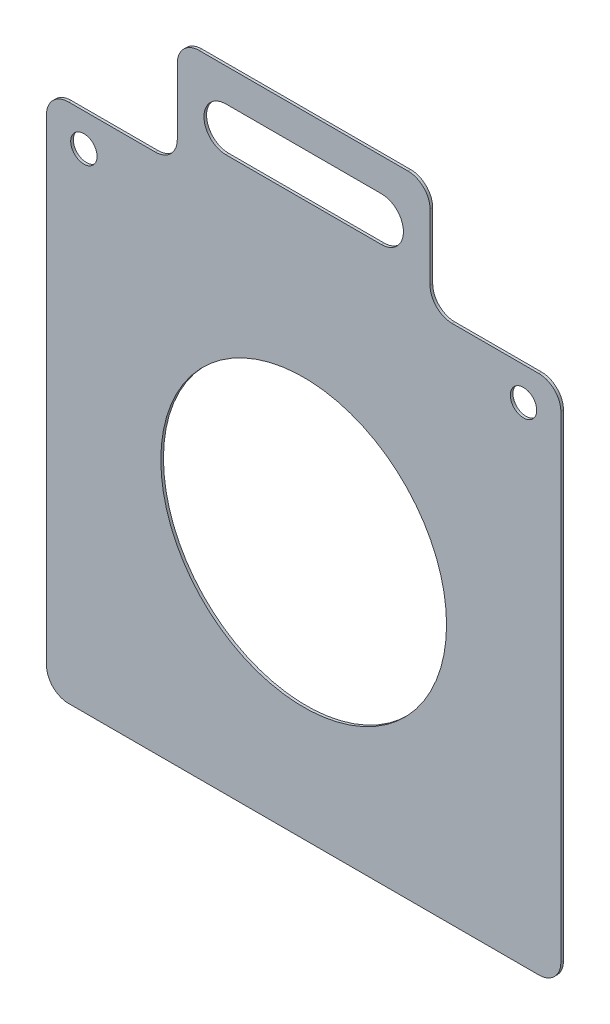
ISO-10303-21;
HEADER;
FILE_DESCRIPTION(('STEP AP214'),'2;1');
FILE_NAME('part.step','',(''),(''),'','','');
FILE_SCHEMA(('AUTOMOTIVE_DESIGN { 1 0 10303 214 1 1 1 1 }'));
ENDSEC;
DATA;
#1=APPLICATION_CONTEXT('core data for automotive mechanical design processes');
#2=APPLICATION_PROTOCOL_DEFINITION('international standard','automotive_design',2000,#1);
#3=PRODUCT_CONTEXT('',#1,'mechanical');
#4=PRODUCT('Part','Part','',(#3));
#5=PRODUCT_RELATED_PRODUCT_CATEGORY('part','',(#4));
#6=PRODUCT_DEFINITION_FORMATION('','',#4);
#7=PRODUCT_DEFINITION_CONTEXT('part definition',#1,'design');
#8=PRODUCT_DEFINITION('design','',#6,#7);
#9=PRODUCT_DEFINITION_SHAPE('','',#8);
#10=(LENGTH_UNIT() NAMED_UNIT(*) SI_UNIT(.MILLI.,.METRE.));
#11=(NAMED_UNIT(*) PLANE_ANGLE_UNIT() SI_UNIT($,.RADIAN.));
#12=(NAMED_UNIT(*) SI_UNIT($,.STERADIAN.) SOLID_ANGLE_UNIT());
#13=UNCERTAINTY_MEASURE_WITH_UNIT(LENGTH_MEASURE(1.E-05),#10,'distance_accuracy_value','');
#14=(GEOMETRIC_REPRESENTATION_CONTEXT(3) GLOBAL_UNCERTAINTY_ASSIGNED_CONTEXT((#13)) GLOBAL_UNIT_ASSIGNED_CONTEXT((#10,
#11,#12)) REPRESENTATION_CONTEXT('',''));
#15=CARTESIAN_POINT('',(0.,0.,0.));
#16=DIRECTION('',(0.,0.,1.));
#17=DIRECTION('',(1.,0.,0.));
#18=AXIS2_PLACEMENT_3D('',#15,#16,#17);
#19=CARTESIAN_POINT('',(-117.,120.000000000001,1.20000000000002));
#20=DIRECTION('',(0.,-1.,0.));
#21=DIRECTION('',(1.,0.,0.));
#22=AXIS2_PLACEMENT_3D('',#19,#20,#21);
#23=PLANE('',#22);
#24=DIRECTION('',(-1.,0.,0.));
#25=VECTOR('',#24,1.);
#26=CARTESIAN_POINT('',(-117.,120.000000000001,1.20000000000002));
#27=LINE('',#26,#25);
#28=CARTESIAN_POINT('',(-67.5000000000001,120.000000000001,1.20000000000002));
#29=VERTEX_POINT('',#28);
#30=CARTESIAN_POINT('',(-107.,120.,1.20000000000002));
#31=VERTEX_POINT('',#30);
#32=EDGE_CURVE('E276',#29,#31,#27,.T.);
#33=ORIENTED_EDGE('',*,*,#32,.F.);
#34=DIRECTION('',(0.,0.,1.));
#35=VECTOR('',#34,1.);
#36=CARTESIAN_POINT('',(-67.5000000000001,120.000000000001,1.20000000000002));
#37=LINE('',#36,#35);
#38=CARTESIAN_POINT('',(-67.5000000000001,120.000000000001,0.));
#39=VERTEX_POINT('',#38);
#40=EDGE_CURVE('E361',#29,#39,#37,.F.);
#41=ORIENTED_EDGE('',*,*,#40,.T.);
#42=DIRECTION('',(-1.,0.,0.));
#43=VECTOR('',#42,1.);
#44=CARTESIAN_POINT('',(-117.,120.000000000001,0.));
#45=LINE('',#44,#43);
#46=CARTESIAN_POINT('',(-107.,120.,0.));
#47=VERTEX_POINT('',#46);
#48=EDGE_CURVE('E291',#39,#47,#45,.T.);
#49=ORIENTED_EDGE('',*,*,#48,.T.);
#50=DIRECTION('',(0.,0.,-1.));
#51=VECTOR('',#50,1.);
#52=CARTESIAN_POINT('',(-107.,120.,1.20000000000002));
#53=LINE('',#52,#51);
#54=EDGE_CURVE('E358',#47,#31,#53,.F.);
#55=ORIENTED_EDGE('',*,*,#54,.T.);
#56=EDGE_LOOP('',(#33,#41,#49,#55));
#57=FACE_BOUND('',#56,.T.);
#58=ADVANCED_FACE('F40',(#57),#23,.F.);
#59=CARTESIAN_POINT('',(0.,0.,1.20000000000001));
#60=DIRECTION('',(0.,0.,1.));
#61=DIRECTION('',(1.,0.,0.));
#62=AXIS2_PLACEMENT_3D('',#59,#60,#61);
#63=PLANE('',#62);
#64=CARTESIAN_POINT('',(-100.,105.,1.20000000000002));
#65=DIRECTION('',(0.,0.,1.));
#66=DIRECTION('',(1.,0.,0.));
#67=AXIS2_PLACEMENT_3D('',#64,#65,#66);
#68=CIRCLE('',#67,6.);
#69=CARTESIAN_POINT('',(-94.0000000000003,105.,1.20000000000002));
#70=VERTEX_POINT('',#69);
#71=EDGE_CURVE('E247',#70,#70,#68,.T.);
#72=ORIENTED_EDGE('',*,*,#71,.F.);
#73=EDGE_LOOP('',(#72));
#74=FACE_BOUND('',#73,.T.);
#75=DIRECTION('',(0.,1.,0.));
#76=VECTOR('',#75,1.);
#77=CARTESIAN_POINT('',(57.5000000000002,170.000000000002,1.20000000000002));
#78=LINE('',#77,#76);
#79=CARTESIAN_POINT('',(57.5000000000003,130.000000000001,1.20000000000002));
#80=VERTEX_POINT('',#79);
#81=CARTESIAN_POINT('',(57.5000000000001,160.000000000002,1.20000000000002));
#82=VERTEX_POINT('',#81);
#83=EDGE_CURVE('E217',#80,#82,#78,.T.);
#84=ORIENTED_EDGE('',*,*,#83,.T.);
#85=CARTESIAN_POINT('',(47.5,160.000000000002,1.20000000000002));
#86=DIRECTION('',(0.,0.,1.));
#87=DIRECTION('',(1.,0.,0.));
#88=AXIS2_PLACEMENT_3D('',#85,#86,#87);
#89=CIRCLE('',#88,10.);
#90=CARTESIAN_POINT('',(47.5000000000002,170.000000000002,1.20000000000002));
#91=VERTEX_POINT('',#90);
#92=EDGE_CURVE('E325',#82,#91,#89,.T.);
#93=ORIENTED_EDGE('',*,*,#92,.T.);
#94=DIRECTION('',(-1.,0.,0.));
#95=VECTOR('',#94,1.);
#96=CARTESIAN_POINT('',(-57.5000000000002,170.000000000002,1.20000000000002));
#97=LINE('',#96,#95);
#98=CARTESIAN_POINT('',(-47.5000000000001,170.000000000002,1.20000000000002));
#99=VERTEX_POINT('',#98);
#100=EDGE_CURVE('E225',#91,#99,#97,.T.);
#101=ORIENTED_EDGE('',*,*,#100,.T.);
#102=CARTESIAN_POINT('',(-47.5,160.000000000002,1.20000000000002));
#103=DIRECTION('',(0.,0.,1.));
#104=DIRECTION('',(1.,0.,0.));
#105=AXIS2_PLACEMENT_3D('',#102,#103,#104);
#106=CIRCLE('',#105,10.);
#107=CARTESIAN_POINT('',(-57.5,160.000000000002,1.20000000000002));
#108=VERTEX_POINT('',#107);
#109=EDGE_CURVE('E322',#99,#108,#106,.T.);
#110=ORIENTED_EDGE('',*,*,#109,.T.);
#111=DIRECTION('',(0.,-1.,0.));
#112=VECTOR('',#111,1.);
#113=CARTESIAN_POINT('',(-57.4999999999999,120.000000000002,1.20000000000002));
#114=LINE('',#113,#112);
#115=CARTESIAN_POINT('',(-57.5000000000001,130.000000000001,1.20000000000001));
#116=VERTEX_POINT('',#115);
#117=EDGE_CURVE('E229',#108,#116,#114,.T.);
#118=ORIENTED_EDGE('',*,*,#117,.T.);
#119=CARTESIAN_POINT('',(-67.5,130.000000000001,1.20000000000001));
#120=DIRECTION('',(0.,0.,1.));
#121=DIRECTION('',(1.,0.,0.));
#122=AXIS2_PLACEMENT_3D('',#119,#120,#121);
#123=CIRCLE('',#122,10.);
#124=EDGE_CURVE('E49',#116,#29,#123,.F.);
#125=ORIENTED_EDGE('',*,*,#124,.T.);
#126=ORIENTED_EDGE('',*,*,#32,.T.);
#127=CARTESIAN_POINT('',(-107.,110.,1.20000000000002));
#128=DIRECTION('',(0.,0.,1.));
#129=DIRECTION('',(1.,0.,0.));
#130=AXIS2_PLACEMENT_3D('',#127,#128,#129);
#131=CIRCLE('',#130,10.);
#132=CARTESIAN_POINT('',(-117.,110.,1.20000000000002));
#133=VERTEX_POINT('',#132);
#134=EDGE_CURVE('E319',#31,#133,#131,.T.);
#135=ORIENTED_EDGE('',*,*,#134,.T.);
#136=DIRECTION('',(0.,-1.,0.));
#137=VECTOR('',#136,1.);
#138=CARTESIAN_POINT('',(-117.,120.000000000001,1.20000000000002));
#139=LINE('',#138,#137);
#140=CARTESIAN_POINT('',(-117.,-107.,1.20000000000001));
#141=VERTEX_POINT('',#140);
#142=EDGE_CURVE('E263',#133,#141,#139,.T.);
#143=ORIENTED_EDGE('',*,*,#142,.T.);
#144=CARTESIAN_POINT('',(-107.,-107.,1.20000000000001));
#145=DIRECTION('',(0.,0.,1.));
#146=DIRECTION('',(1.,0.,0.));
#147=AXIS2_PLACEMENT_3D('',#144,#145,#146);
#148=CIRCLE('',#147,10.);
#149=CARTESIAN_POINT('',(-107.,-117.,1.20000000000001));
#150=VERTEX_POINT('',#149);
#151=EDGE_CURVE('E313',#141,#150,#148,.T.);
#152=ORIENTED_EDGE('',*,*,#151,.T.);
#153=DIRECTION('',(1.,0.,0.));
#154=VECTOR('',#153,1.);
#155=CARTESIAN_POINT('',(-117.,-117.,1.20000000000001));
#156=LINE('',#155,#154);
#157=CARTESIAN_POINT('',(107.,-117.,1.20000000000001));
#158=VERTEX_POINT('',#157);
#159=EDGE_CURVE('E267',#150,#158,#156,.T.);
#160=ORIENTED_EDGE('',*,*,#159,.T.);
#161=CARTESIAN_POINT('',(107.,-107.,1.20000000000001));
#162=DIRECTION('',(0.,0.,1.));
#163=DIRECTION('',(1.,0.,0.));
#164=AXIS2_PLACEMENT_3D('',#161,#162,#163);
#165=CIRCLE('',#164,10.);
#166=CARTESIAN_POINT('',(117.,-107.,1.20000000000001));
#167=VERTEX_POINT('',#166);
#168=EDGE_CURVE('E316',#158,#167,#165,.T.);
#169=ORIENTED_EDGE('',*,*,#168,.T.);
#170=DIRECTION('',(0.,1.,0.));
#171=VECTOR('',#170,1.);
#172=CARTESIAN_POINT('',(117.,120.000000000001,1.19999999999998));
#173=LINE('',#172,#171);
#174=CARTESIAN_POINT('',(117.,110.,1.19999999999998));
#175=VERTEX_POINT('',#174);
#176=EDGE_CURVE('E272',#167,#175,#173,.T.);
#177=ORIENTED_EDGE('',*,*,#176,.T.);
#178=CARTESIAN_POINT('',(107.,110.000000000001,1.19999999999998));
#179=DIRECTION('',(0.,0.,1.));
#180=DIRECTION('',(1.,0.,0.));
#181=AXIS2_PLACEMENT_3D('',#178,#179,#180);
#182=CIRCLE('',#181,10.);
#183=CARTESIAN_POINT('',(107.,120.000000000001,1.19999999999998));
#184=VERTEX_POINT('',#183);
#185=EDGE_CURVE('E310',#175,#184,#182,.T.);
#186=ORIENTED_EDGE('',*,*,#185,.T.);
#187=CARTESIAN_POINT('',(67.5000000000001,120.000000000001,1.19999999999998));
#188=VERTEX_POINT('',#187);
#189=EDGE_CURVE('E280',#184,#188,#27,.T.);
#190=ORIENTED_EDGE('',*,*,#189,.T.);
#191=CARTESIAN_POINT('',(67.5000000000003,130.000000000001,1.19999999999998));
#192=DIRECTION('',(0.,0.,1.));
#193=DIRECTION('',(1.,0.,0.));
#194=AXIS2_PLACEMENT_3D('',#191,#192,#193);
#195=CIRCLE('',#194,10.);
#196=EDGE_CURVE('E384',#188,#80,#195,.F.);
#197=ORIENTED_EDGE('',*,*,#196,.T.);
#198=EDGE_LOOP('',(#84,#93,#101,#110,#118,#125,#126,#135,#143,#152,#160,#169,#177,#186,#190,#197));
#199=FACE_BOUND('',#198,.T.);
#200=CARTESIAN_POINT('',(0.,0.,1.20000000000001));
#201=DIRECTION('',(0.,0.,1.));
#202=DIRECTION('',(1.,0.,0.));
#203=AXIS2_PLACEMENT_3D('',#200,#201,#202);
#204=CIRCLE('',#203,65.);
#205=CARTESIAN_POINT('',(65.0000000000001,0.,1.20000000000001));
#206=VERTEX_POINT('',#205);
#207=EDGE_CURVE('E255',#206,#206,#204,.T.);
#208=ORIENTED_EDGE('',*,*,#207,.F.);
#209=EDGE_LOOP('',(#208));
#210=FACE_BOUND('',#209,.T.);
#211=CARTESIAN_POINT('',(100.,105.000000000001,1.19999999999998));
#212=DIRECTION('',(0.,0.,1.));
#213=DIRECTION('',(-1.,0.,0.));
#214=AXIS2_PLACEMENT_3D('',#211,#212,#213);
#215=CIRCLE('',#214,6.);
#216=CARTESIAN_POINT('',(94.0000000000002,105.000000000001,1.19999999999998));
#217=VERTEX_POINT('',#216);
#218=EDGE_CURVE('E237',#217,#217,#215,.T.);
#219=ORIENTED_EDGE('',*,*,#218,.F.);
#220=EDGE_LOOP('',(#219));
#221=FACE_BOUND('',#220,.T.);
#222=DIRECTION('',(1.,0.,0.));
#223=VECTOR('',#222,1.);
#224=CARTESIAN_POINT('',(-35.3706002300001,134.999999999999,1.20000000000002));
#225=LINE('',#224,#223);
#226=CARTESIAN_POINT('',(-35.3706002300001,134.999999999999,1.20000000000002));
#227=VERTEX_POINT('',#226);
#228=CARTESIAN_POINT('',(35.3706002300002,135.,1.20000000000002));
#229=VERTEX_POINT('',#228);
#230=EDGE_CURVE('E195',#227,#229,#225,.T.);
#231=ORIENTED_EDGE('',*,*,#230,.F.);
#232=CARTESIAN_POINT('',(-35.3706002300002,145.000000000002,1.20000000000002));
#233=DIRECTION('',(0.,0.,1.));
#234=DIRECTION('',(1.,0.,0.));
#235=AXIS2_PLACEMENT_3D('',#232,#233,#234);
#236=CIRCLE('',#235,10.0000000000015);
#237=CARTESIAN_POINT('',(-35.3706002300001,155.000000000002,1.20000000000002));
#238=VERTEX_POINT('',#237);
#239=EDGE_CURVE('E202',#238,#227,#236,.T.);
#240=ORIENTED_EDGE('',*,*,#239,.F.);
#241=DIRECTION('',(-1.,0.,0.));
#242=VECTOR('',#241,1.);
#243=CARTESIAN_POINT('',(-35.3706002300001,155.000000000002,1.20000000000002));
#244=LINE('',#243,#242);
#245=CARTESIAN_POINT('',(35.3706002300001,155.000000000002,1.20000000000002));
#246=VERTEX_POINT('',#245);
#247=EDGE_CURVE('E206',#246,#238,#244,.T.);
#248=ORIENTED_EDGE('',*,*,#247,.F.);
#249=CARTESIAN_POINT('',(35.3706002300001,145.000000000002,1.20000000000002));
#250=DIRECTION('',(0.,0.,1.));
#251=DIRECTION('',(1.,0.,0.));
#252=AXIS2_PLACEMENT_3D('',#249,#250,#251);
#253=CIRCLE('',#252,10.0000000000015);
#254=EDGE_CURVE('E185',#229,#246,#253,.T.);
#255=ORIENTED_EDGE('',*,*,#254,.F.);
#256=EDGE_LOOP('',(#231,#240,#248,#255));
#257=FACE_BOUND('',#256,.T.);
#258=ADVANCED_FACE('F204',(#74,#199,#210,#221,#257),#63,.T.);
#259=CARTESIAN_POINT('',(0.,0.,0.));
#260=DIRECTION('',(0.,0.,1.));
#261=DIRECTION('',(1.,0.,0.));
#262=AXIS2_PLACEMENT_3D('',#259,#260,#261);
#263=PLANE('',#262);
#264=DIRECTION('',(1.,0.,0.));
#265=VECTOR('',#264,1.);
#266=CARTESIAN_POINT('',(-57.5000000000002,170.000000000002,0.));
#267=LINE('',#266,#265);
#268=CARTESIAN_POINT('',(-47.5000000000001,170.000000000002,0.));
#269=VERTEX_POINT('',#268);
#270=CARTESIAN_POINT('',(47.5000000000002,170.000000000002,0.));
#271=VERTEX_POINT('',#270);
#272=EDGE_CURVE('E236',#269,#271,#267,.T.);
#273=ORIENTED_EDGE('',*,*,#272,.T.);
#274=CARTESIAN_POINT('',(47.5,160.000000000002,0.));
#275=DIRECTION('',(0.,0.,1.));
#276=DIRECTION('',(1.,0.,0.));
#277=AXIS2_PLACEMENT_3D('',#274,#275,#276);
#278=CIRCLE('',#277,10.);
#279=CARTESIAN_POINT('',(57.5000000000001,160.000000000002,0.));
#280=VERTEX_POINT('',#279);
#281=EDGE_CURVE('E348',#271,#280,#278,.F.);
#282=ORIENTED_EDGE('',*,*,#281,.T.);
#283=DIRECTION('',(0.,-1.,0.));
#284=VECTOR('',#283,1.);
#285=CARTESIAN_POINT('',(57.5000000000002,170.000000000002,0.));
#286=LINE('',#285,#284);
#287=CARTESIAN_POINT('',(57.5000000000003,130.000000000001,0.));
#288=VERTEX_POINT('',#287);
#289=EDGE_CURVE('E246',#280,#288,#286,.T.);
#290=ORIENTED_EDGE('',*,*,#289,.T.);
#291=CARTESIAN_POINT('',(67.5000000000003,130.000000000001,0.));
#292=DIRECTION('',(0.,0.,1.));
#293=DIRECTION('',(1.,0.,0.));
#294=AXIS2_PLACEMENT_3D('',#291,#292,#293);
#295=CIRCLE('',#294,10.);
#296=CARTESIAN_POINT('',(67.5000000000001,120.000000000001,0.));
#297=VERTEX_POINT('',#296);
#298=EDGE_CURVE('E387',#288,#297,#295,.T.);
#299=ORIENTED_EDGE('',*,*,#298,.T.);
#300=CARTESIAN_POINT('',(107.,120.000000000001,0.));
#301=VERTEX_POINT('',#300);
#302=EDGE_CURVE('E268',#301,#297,#45,.T.);
#303=ORIENTED_EDGE('',*,*,#302,.F.);
#304=CARTESIAN_POINT('',(107.,110.000000000001,0.));
#305=DIRECTION('',(0.,0.,1.));
#306=DIRECTION('',(1.,0.,0.));
#307=AXIS2_PLACEMENT_3D('',#304,#305,#306);
#308=CIRCLE('',#307,10.);
#309=CARTESIAN_POINT('',(117.,110.,0.));
#310=VERTEX_POINT('',#309);
#311=EDGE_CURVE('E335',#301,#310,#308,.F.);
#312=ORIENTED_EDGE('',*,*,#311,.T.);
#313=DIRECTION('',(0.,1.,0.));
#314=VECTOR('',#313,1.);
#315=CARTESIAN_POINT('',(117.,120.000000000001,0.));
#316=LINE('',#315,#314);
#317=CARTESIAN_POINT('',(117.,-107.,0.));
#318=VERTEX_POINT('',#317);
#319=EDGE_CURVE('E287',#318,#310,#316,.T.);
#320=ORIENTED_EDGE('',*,*,#319,.F.);
#321=CARTESIAN_POINT('',(107.,-107.,0.));
#322=DIRECTION('',(0.,0.,1.));
#323=DIRECTION('',(1.,0.,0.));
#324=AXIS2_PLACEMENT_3D('',#321,#322,#323);
#325=CIRCLE('',#324,10.);
#326=CARTESIAN_POINT('',(107.,-117.,0.));
#327=VERTEX_POINT('',#326);
#328=EDGE_CURVE('E56',#318,#327,#325,.F.);
#329=ORIENTED_EDGE('',*,*,#328,.T.);
#330=DIRECTION('',(1.,0.,0.));
#331=VECTOR('',#330,1.);
#332=CARTESIAN_POINT('',(-117.,-117.,0.));
#333=LINE('',#332,#331);
#334=CARTESIAN_POINT('',(-107.,-117.,0.));
#335=VERTEX_POINT('',#334);
#336=EDGE_CURVE('E284',#335,#327,#333,.T.);
#337=ORIENTED_EDGE('',*,*,#336,.F.);
#338=CARTESIAN_POINT('',(-107.,-107.,0.));
#339=DIRECTION('',(0.,0.,1.));
#340=DIRECTION('',(1.,0.,0.));
#341=AXIS2_PLACEMENT_3D('',#338,#339,#340);
#342=CIRCLE('',#341,10.);
#343=CARTESIAN_POINT('',(-117.,-107.,0.));
#344=VERTEX_POINT('',#343);
#345=EDGE_CURVE('E64',#335,#344,#342,.F.);
#346=ORIENTED_EDGE('',*,*,#345,.T.);
#347=DIRECTION('',(0.,-1.,0.));
#348=VECTOR('',#347,1.);
#349=CARTESIAN_POINT('',(-117.,120.000000000001,0.));
#350=LINE('',#349,#348);
#351=CARTESIAN_POINT('',(-117.,110.,0.));
#352=VERTEX_POINT('',#351);
#353=EDGE_CURVE('E259',#352,#344,#350,.T.);
#354=ORIENTED_EDGE('',*,*,#353,.F.);
#355=CARTESIAN_POINT('',(-107.,110.,0.));
#356=DIRECTION('',(0.,0.,1.));
#357=DIRECTION('',(1.,0.,0.));
#358=AXIS2_PLACEMENT_3D('',#355,#356,#357);
#359=CIRCLE('',#358,10.);
#360=EDGE_CURVE('E342',#352,#47,#359,.F.);
#361=ORIENTED_EDGE('',*,*,#360,.T.);
#362=ORIENTED_EDGE('',*,*,#48,.F.);
#363=CARTESIAN_POINT('',(-67.5,130.000000000001,0.));
#364=DIRECTION('',(0.,0.,1.));
#365=DIRECTION('',(1.,0.,0.));
#366=AXIS2_PLACEMENT_3D('',#363,#364,#365);
#367=CIRCLE('',#366,10.);
#368=CARTESIAN_POINT('',(-57.5000000000001,130.000000000001,0.));
#369=VERTEX_POINT('',#368);
#370=EDGE_CURVE('E11',#39,#369,#367,.T.);
#371=ORIENTED_EDGE('',*,*,#370,.T.);
#372=DIRECTION('',(0.,1.,0.));
#373=VECTOR('',#372,1.);
#374=CARTESIAN_POINT('',(-57.4999999999999,120.000000000002,0.));
#375=LINE('',#374,#373);
#376=CARTESIAN_POINT('',(-57.5,160.000000000002,0.));
#377=VERTEX_POINT('',#376);
#378=EDGE_CURVE('E410',#369,#377,#375,.T.);
#379=ORIENTED_EDGE('',*,*,#378,.T.);
#380=CARTESIAN_POINT('',(-47.5,160.000000000002,0.));
#381=DIRECTION('',(0.,0.,1.));
#382=DIRECTION('',(1.,0.,0.));
#383=AXIS2_PLACEMENT_3D('',#380,#381,#382);
#384=CIRCLE('',#383,10.);
#385=EDGE_CURVE('E345',#377,#269,#384,.F.);
#386=ORIENTED_EDGE('',*,*,#385,.T.);
#387=EDGE_LOOP('',(#273,#282,#290,#299,#303,#312,#320,#329,#337,#346,#354,#361,#362,#371,#379,#386));
#388=FACE_BOUND('',#387,.T.);
#389=CARTESIAN_POINT('',(0.,0.,0.));
#390=DIRECTION('',(0.,0.,1.));
#391=DIRECTION('',(1.,0.,0.));
#392=AXIS2_PLACEMENT_3D('',#389,#390,#391);
#393=CIRCLE('',#392,65.);
#394=CARTESIAN_POINT('',(65.0000000000001,0.,0.));
#395=VERTEX_POINT('',#394);
#396=EDGE_CURVE('E251',#395,#395,#393,.T.);
#397=ORIENTED_EDGE('',*,*,#396,.T.);
#398=EDGE_LOOP('',(#397));
#399=FACE_BOUND('',#398,.T.);
#400=CARTESIAN_POINT('',(-100.,105.,0.));
#401=DIRECTION('',(0.,0.,1.));
#402=DIRECTION('',(1.,0.,0.));
#403=AXIS2_PLACEMENT_3D('',#400,#401,#402);
#404=CIRCLE('',#403,6.);
#405=CARTESIAN_POINT('',(-94.0000000000003,105.,0.));
#406=VERTEX_POINT('',#405);
#407=EDGE_CURVE('E241',#406,#406,#404,.T.);
#408=ORIENTED_EDGE('',*,*,#407,.T.);
#409=EDGE_LOOP('',(#408));
#410=FACE_BOUND('',#409,.T.);
#411=CARTESIAN_POINT('',(100.,105.000000000001,0.));
#412=DIRECTION('',(0.,0.,1.));
#413=DIRECTION('',(-1.,0.,0.));
#414=AXIS2_PLACEMENT_3D('',#411,#412,#413);
#415=CIRCLE('',#414,6.);
#416=CARTESIAN_POINT('',(94.0000000000002,105.000000000001,0.));
#417=VERTEX_POINT('',#416);
#418=EDGE_CURVE('E242',#417,#417,#415,.T.);
#419=ORIENTED_EDGE('',*,*,#418,.T.);
#420=EDGE_LOOP('',(#419));
#421=FACE_BOUND('',#420,.T.);
#422=DIRECTION('',(-1.,0.,0.));
#423=VECTOR('',#422,1.);
#424=CARTESIAN_POINT('',(-35.3706002300001,134.999999999999,0.));
#425=LINE('',#424,#423);
#426=CARTESIAN_POINT('',(35.3706002300001,134.999999999999,0.));
#427=VERTEX_POINT('',#426);
#428=CARTESIAN_POINT('',(-35.3706002300001,134.999999999999,0.));
#429=VERTEX_POINT('',#428);
#430=EDGE_CURVE('E233',#427,#429,#425,.T.);
#431=ORIENTED_EDGE('',*,*,#430,.F.);
#432=CARTESIAN_POINT('',(35.3706002300001,145.000000000002,0.));
#433=DIRECTION('',(0.,0.,1.));
#434=DIRECTION('',(1.,0.,0.));
#435=AXIS2_PLACEMENT_3D('',#432,#433,#434);
#436=CIRCLE('',#435,10.0000000000015);
#437=CARTESIAN_POINT('',(35.3706002300001,155.000000000004,0.));
#438=VERTEX_POINT('',#437);
#439=EDGE_CURVE('E187',#438,#427,#436,.F.);
#440=ORIENTED_EDGE('',*,*,#439,.F.);
#441=DIRECTION('',(1.,0.,0.));
#442=VECTOR('',#441,1.);
#443=CARTESIAN_POINT('',(-35.3706002300001,155.000000000002,0.));
#444=LINE('',#443,#442);
#445=CARTESIAN_POINT('',(-35.3706002300001,155.000000000002,0.));
#446=VERTEX_POINT('',#445);
#447=EDGE_CURVE('E420',#446,#438,#444,.T.);
#448=ORIENTED_EDGE('',*,*,#447,.F.);
#449=CARTESIAN_POINT('',(-35.3706002300002,145.000000000002,0.));
#450=DIRECTION('',(0.,0.,1.));
#451=DIRECTION('',(1.,0.,0.));
#452=AXIS2_PLACEMENT_3D('',#449,#450,#451);
#453=CIRCLE('',#452,10.0000000000015);
#454=EDGE_CURVE('E415',#429,#446,#453,.F.);
#455=ORIENTED_EDGE('',*,*,#454,.F.);
#456=EDGE_LOOP('',(#431,#440,#448,#455));
#457=FACE_BOUND('',#456,.T.);
#458=ADVANCED_FACE('F408',(#388,#399,#410,#421,#457),#263,.F.);
#459=CARTESIAN_POINT('',(-117.,120.000000000001,1.20000000000002));
#460=DIRECTION('',(1.,0.,0.));
#461=DIRECTION('',(0.,1.,0.));
#462=AXIS2_PLACEMENT_3D('',#459,#460,#461);
#463=PLANE('',#462);
#464=ORIENTED_EDGE('',*,*,#142,.F.);
#465=DIRECTION('',(0.,0.,-1.));
#466=VECTOR('',#465,1.);
#467=CARTESIAN_POINT('',(-117.,110.,1.20000000000002));
#468=LINE('',#467,#466);
#469=EDGE_CURVE('E367',#133,#352,#468,.T.);
#470=ORIENTED_EDGE('',*,*,#469,.T.);
#471=ORIENTED_EDGE('',*,*,#353,.T.);
#472=DIRECTION('',(0.,0.,-1.));
#473=VECTOR('',#472,1.);
#474=CARTESIAN_POINT('',(-117.,-107.,1.20000000000001));
#475=LINE('',#474,#473);
#476=EDGE_CURVE('E364',#344,#141,#475,.F.);
#477=ORIENTED_EDGE('',*,*,#476,.T.);
#478=EDGE_LOOP('',(#464,#470,#471,#477));
#479=FACE_BOUND('',#478,.T.);
#480=ADVANCED_FACE('F482',(#479),#463,.F.);
#481=CARTESIAN_POINT('',(-117.,-117.,1.20000000000001));
#482=DIRECTION('',(0.,1.,0.));
#483=DIRECTION('',(-1.,0.,0.));
#484=AXIS2_PLACEMENT_3D('',#481,#482,#483);
#485=PLANE('',#484);
#486=ORIENTED_EDGE('',*,*,#336,.T.);
#487=DIRECTION('',(0.,0.,-1.));
#488=VECTOR('',#487,1.);
#489=CARTESIAN_POINT('',(107.,-117.,1.20000000000001));
#490=LINE('',#489,#488);
#491=EDGE_CURVE('E381',#327,#158,#490,.F.);
#492=ORIENTED_EDGE('',*,*,#491,.T.);
#493=ORIENTED_EDGE('',*,*,#159,.F.);
#494=DIRECTION('',(0.,0.,-1.));
#495=VECTOR('',#494,1.);
#496=CARTESIAN_POINT('',(-107.,-117.,1.20000000000001));
#497=LINE('',#496,#495);
#498=EDGE_CURVE('E378',#150,#335,#497,.T.);
#499=ORIENTED_EDGE('',*,*,#498,.T.);
#500=EDGE_LOOP('',(#486,#492,#493,#499));
#501=FACE_BOUND('',#500,.T.);
#502=ADVANCED_FACE('F476',(#501),#485,.F.);
#503=CARTESIAN_POINT('',(117.,120.000000000001,1.19999999999998));
#504=DIRECTION('',(-1.,0.,0.));
#505=DIRECTION('',(0.,-1.,0.));
#506=AXIS2_PLACEMENT_3D('',#503,#504,#505);
#507=PLANE('',#506);
#508=ORIENTED_EDGE('',*,*,#176,.F.);
#509=DIRECTION('',(0.,0.,-1.));
#510=VECTOR('',#509,1.);
#511=CARTESIAN_POINT('',(117.,-107.,1.20000000000001));
#512=LINE('',#511,#510);
#513=EDGE_CURVE('E374',#167,#318,#512,.T.);
#514=ORIENTED_EDGE('',*,*,#513,.T.);
#515=ORIENTED_EDGE('',*,*,#319,.T.);
#516=DIRECTION('',(0.,0.,-1.));
#517=VECTOR('',#516,1.);
#518=CARTESIAN_POINT('',(117.,110.,1.19999999999998));
#519=LINE('',#518,#517);
#520=EDGE_CURVE('E371',#310,#175,#519,.F.);
#521=ORIENTED_EDGE('',*,*,#520,.T.);
#522=EDGE_LOOP('',(#508,#514,#515,#521));
#523=FACE_BOUND('',#522,.T.);
#524=ADVANCED_FACE('F468',(#523),#507,.F.);
#525=ORIENTED_EDGE('',*,*,#302,.T.);
#526=DIRECTION('',(0.,0.,1.));
#527=VECTOR('',#526,1.);
#528=CARTESIAN_POINT('',(67.5000000000003,120.000000000001,1.19999999999998));
#529=LINE('',#528,#527);
#530=EDGE_CURVE('E299',#297,#188,#529,.T.);
#531=ORIENTED_EDGE('',*,*,#530,.T.);
#532=ORIENTED_EDGE('',*,*,#189,.F.);
#533=DIRECTION('',(0.,0.,-1.));
#534=VECTOR('',#533,1.);
#535=CARTESIAN_POINT('',(107.,120.000000000001,1.19999999999998));
#536=LINE('',#535,#534);
#537=EDGE_CURVE('E295',#184,#301,#536,.T.);
#538=ORIENTED_EDGE('',*,*,#537,.T.);
#539=EDGE_LOOP('',(#525,#531,#532,#538));
#540=FACE_BOUND('',#539,.T.);
#541=ADVANCED_FACE('F457',(#540),#23,.F.);
#542=CARTESIAN_POINT('',(0.,0.,1.20000000000001));
#543=DIRECTION('',(0.,0.,-1.));
#544=DIRECTION('',(-1.,0.,0.));
#545=AXIS2_PLACEMENT_3D('',#542,#543,#544);
#546=CYLINDRICAL_SURFACE('',#545,65.);
#547=ORIENTED_EDGE('',*,*,#207,.T.);
#548=EDGE_LOOP('',(#547));
#549=FACE_BOUND('',#548,.T.);
#550=ORIENTED_EDGE('',*,*,#396,.F.);
#551=EDGE_LOOP('',(#550));
#552=FACE_BOUND('',#551,.T.);
#553=ADVANCED_FACE('F505',(#549,#552),#546,.F.);
#554=CARTESIAN_POINT('',(-100.,105.,1.20000000000002));
#555=DIRECTION('',(0.,0.,-1.));
#556=DIRECTION('',(-1.,0.,0.));
#557=AXIS2_PLACEMENT_3D('',#554,#555,#556);
#558=CYLINDRICAL_SURFACE('',#557,6.);
#559=ORIENTED_EDGE('',*,*,#71,.T.);
#560=EDGE_LOOP('',(#559));
#561=FACE_BOUND('',#560,.T.);
#562=ORIENTED_EDGE('',*,*,#407,.F.);
#563=EDGE_LOOP('',(#562));
#564=FACE_BOUND('',#563,.T.);
#565=ADVANCED_FACE('F510',(#561,#564),#558,.F.);
#566=CARTESIAN_POINT('',(100.,105.000000000001,1.19999999999998));
#567=DIRECTION('',(0.,0.,-1.));
#568=DIRECTION('',(-1.,0.,0.));
#569=AXIS2_PLACEMENT_3D('',#566,#567,#568);
#570=CYLINDRICAL_SURFACE('',#569,6.);
#571=ORIENTED_EDGE('',*,*,#218,.T.);
#572=EDGE_LOOP('',(#571));
#573=FACE_BOUND('',#572,.T.);
#574=ORIENTED_EDGE('',*,*,#418,.F.);
#575=EDGE_LOOP('',(#574));
#576=FACE_BOUND('',#575,.T.);
#577=ADVANCED_FACE('F538',(#573,#576),#570,.F.);
#578=CARTESIAN_POINT('',(57.5000000000002,170.000000000002,-125.399362039844));
#579=DIRECTION('',(1.,0.,0.));
#580=DIRECTION('',(0.,1.,0.));
#581=AXIS2_PLACEMENT_3D('',#578,#579,#580);
#582=PLANE('',#581);
#583=ORIENTED_EDGE('',*,*,#83,.F.);
#584=DIRECTION('',(0.,0.,1.));
#585=VECTOR('',#584,1.);
#586=CARTESIAN_POINT('',(57.5000000000003,130.000000000001,-125.399362039844));
#587=LINE('',#586,#585);
#588=EDGE_CURVE('E307',#80,#288,#587,.F.);
#589=ORIENTED_EDGE('',*,*,#588,.T.);
#590=ORIENTED_EDGE('',*,*,#289,.F.);
#591=DIRECTION('',(0.,0.,1.));
#592=VECTOR('',#591,1.);
#593=CARTESIAN_POINT('',(57.5000000000002,160.000000000002,-125.399362039844));
#594=LINE('',#593,#592);
#595=EDGE_CURVE('E303',#280,#82,#594,.T.);
#596=ORIENTED_EDGE('',*,*,#595,.T.);
#597=EDGE_LOOP('',(#583,#589,#590,#596));
#598=FACE_BOUND('',#597,.T.);
#599=ADVANCED_FACE('F536',(#598),#582,.T.);
#600=CARTESIAN_POINT('',(-57.5000000000003,170.000000000002,-125.399362039845));
#601=DIRECTION('',(0.,1.,0.));
#602=DIRECTION('',(0.,0.,1.));
#603=AXIS2_PLACEMENT_3D('',#600,#601,#602);
#604=PLANE('',#603);
#605=ORIENTED_EDGE('',*,*,#100,.F.);
#606=DIRECTION('',(0.,0.,1.));
#607=VECTOR('',#606,1.);
#608=CARTESIAN_POINT('',(47.5000000000002,170.000000000002,-125.399362039844));
#609=LINE('',#608,#607);
#610=EDGE_CURVE('E332',#91,#271,#609,.F.);
#611=ORIENTED_EDGE('',*,*,#610,.T.);
#612=ORIENTED_EDGE('',*,*,#272,.F.);
#613=DIRECTION('',(0.,0.,1.));
#614=VECTOR('',#613,1.);
#615=CARTESIAN_POINT('',(-47.5000000000002,170.000000000002,-125.399362039845));
#616=LINE('',#615,#614);
#617=EDGE_CURVE('E328',#269,#99,#616,.T.);
#618=ORIENTED_EDGE('',*,*,#617,.T.);
#619=EDGE_LOOP('',(#605,#611,#612,#618));
#620=FACE_BOUND('',#619,.T.);
#621=ADVANCED_FACE('F534',(#620),#604,.T.);
#622=CARTESIAN_POINT('',(-57.4999999999999,120.000000000002,-125.399362039845));
#623=DIRECTION('',(-1.,0.,0.));
#624=DIRECTION('',(0.,0.,1.));
#625=AXIS2_PLACEMENT_3D('',#622,#623,#624);
#626=PLANE('',#625);
#627=ORIENTED_EDGE('',*,*,#117,.F.);
#628=DIRECTION('',(0.,0.,1.));
#629=VECTOR('',#628,1.);
#630=CARTESIAN_POINT('',(-57.5000000000002,160.000000000002,-125.399362039845));
#631=LINE('',#630,#629);
#632=EDGE_CURVE('E355',#108,#377,#631,.F.);
#633=ORIENTED_EDGE('',*,*,#632,.T.);
#634=ORIENTED_EDGE('',*,*,#378,.F.);
#635=DIRECTION('',(0.,0.,1.));
#636=VECTOR('',#635,1.);
#637=CARTESIAN_POINT('',(-57.5000000000003,130.000000000001,-125.399362039845));
#638=LINE('',#637,#636);
#639=EDGE_CURVE('E351',#369,#116,#638,.T.);
#640=ORIENTED_EDGE('',*,*,#639,.T.);
#641=EDGE_LOOP('',(#627,#633,#634,#640));
#642=FACE_BOUND('',#641,.T.);
#643=ADVANCED_FACE('F413',(#642),#626,.T.);
#644=CARTESIAN_POINT('',(-35.3706002300003,134.999999999999,-125.399362039845));
#645=DIRECTION('',(0.,-1.,0.));
#646=DIRECTION('',(0.,0.,-1.));
#647=AXIS2_PLACEMENT_3D('',#644,#645,#646);
#648=PLANE('',#647);
#649=DIRECTION('',(0.,0.,1.));
#650=VECTOR('',#649,1.);
#651=CARTESIAN_POINT('',(35.3706002300001,135.,-125.399362039845));
#652=LINE('',#651,#650);
#653=EDGE_CURVE('E180',#427,#229,#652,.T.);
#654=ORIENTED_EDGE('',*,*,#653,.F.);
#655=ORIENTED_EDGE('',*,*,#430,.T.);
#656=DIRECTION('',(0.,0.,1.));
#657=VECTOR('',#656,1.);
#658=CARTESIAN_POINT('',(-35.3706002300003,134.999999999999,-125.399362039845));
#659=LINE('',#658,#657);
#660=EDGE_CURVE('E192',#429,#227,#659,.T.);
#661=ORIENTED_EDGE('',*,*,#660,.T.);
#662=ORIENTED_EDGE('',*,*,#230,.T.);
#663=EDGE_LOOP('',(#654,#655,#661,#662));
#664=FACE_BOUND('',#663,.T.);
#665=ADVANCED_FACE('F196',(#664),#648,.F.);
#666=CARTESIAN_POINT('',(35.3706002300001,145.000000000002,-125.399362039845));
#667=DIRECTION('',(0.,0.,1.));
#668=DIRECTION('',(1.,0.,0.));
#669=AXIS2_PLACEMENT_3D('',#666,#667,#668);
#670=CYLINDRICAL_SURFACE('',#669,10.0000000000015);
#671=DIRECTION('',(0.,0.,1.));
#672=VECTOR('',#671,1.);
#673=CARTESIAN_POINT('',(35.3706002300001,155.000000000002,-125.399362039844));
#674=LINE('',#673,#672);
#675=EDGE_CURVE('E191',#438,#246,#674,.T.);
#676=ORIENTED_EDGE('',*,*,#675,.F.);
#677=ORIENTED_EDGE('',*,*,#439,.T.);
#678=ORIENTED_EDGE('',*,*,#653,.T.);
#679=ORIENTED_EDGE('',*,*,#254,.T.);
#680=EDGE_LOOP('',(#676,#677,#678,#679));
#681=FACE_BOUND('',#680,.T.);
#682=ADVANCED_FACE('F183',(#681),#670,.F.);
#683=CARTESIAN_POINT('',(-35.3706002300002,155.000000000002,-125.399362039845));
#684=DIRECTION('',(0.,1.,0.));
#685=DIRECTION('',(0.,0.,1.));
#686=AXIS2_PLACEMENT_3D('',#683,#684,#685);
#687=PLANE('',#686);
#688=DIRECTION('',(0.,0.,1.));
#689=VECTOR('',#688,1.);
#690=CARTESIAN_POINT('',(-35.3706002300002,155.000000000002,-125.399362039845));
#691=LINE('',#690,#689);
#692=EDGE_CURVE('E214',#446,#238,#691,.T.);
#693=ORIENTED_EDGE('',*,*,#692,.F.);
#694=ORIENTED_EDGE('',*,*,#447,.T.);
#695=ORIENTED_EDGE('',*,*,#675,.T.);
#696=ORIENTED_EDGE('',*,*,#247,.T.);
#697=EDGE_LOOP('',(#693,#694,#695,#696));
#698=FACE_BOUND('',#697,.T.);
#699=ADVANCED_FACE('F433',(#698),#687,.F.);
#700=CARTESIAN_POINT('',(-35.3706002300002,145.000000000002,-125.399362039845));
#701=DIRECTION('',(0.,0.,1.));
#702=DIRECTION('',(1.,0.,0.));
#703=AXIS2_PLACEMENT_3D('',#700,#701,#702);
#704=CYLINDRICAL_SURFACE('',#703,10.0000000000015);
#705=ORIENTED_EDGE('',*,*,#660,.F.);
#706=ORIENTED_EDGE('',*,*,#454,.T.);
#707=ORIENTED_EDGE('',*,*,#692,.T.);
#708=ORIENTED_EDGE('',*,*,#239,.T.);
#709=EDGE_LOOP('',(#705,#706,#707,#708));
#710=FACE_BOUND('',#709,.T.);
#711=ADVANCED_FACE('F429',(#710),#704,.F.);
#712=CARTESIAN_POINT('',(67.5000000000003,130.000000000001,1.19999999999998));
#713=DIRECTION('',(0.,0.,1.));
#714=DIRECTION('',(1.,0.,0.));
#715=AXIS2_PLACEMENT_3D('',#712,#713,#714);
#716=CYLINDRICAL_SURFACE('',#715,10.);
#717=ORIENTED_EDGE('',*,*,#298,.F.);
#718=ORIENTED_EDGE('',*,*,#588,.F.);
#719=ORIENTED_EDGE('',*,*,#196,.F.);
#720=ORIENTED_EDGE('',*,*,#530,.F.);
#721=EDGE_LOOP('',(#717,#718,#719,#720));
#722=FACE_BOUND('',#721,.T.);
#723=ADVANCED_FACE('F453',(#722),#716,.F.);
#724=CARTESIAN_POINT('',(47.5,160.000000000002,-125.399362039844));
#725=DIRECTION('',(0.,0.,1.));
#726=DIRECTION('',(1.,0.,0.));
#727=AXIS2_PLACEMENT_3D('',#724,#725,#726);
#728=CYLINDRICAL_SURFACE('',#727,10.);
#729=ORIENTED_EDGE('',*,*,#281,.F.);
#730=ORIENTED_EDGE('',*,*,#610,.F.);
#731=ORIENTED_EDGE('',*,*,#92,.F.);
#732=ORIENTED_EDGE('',*,*,#595,.F.);
#733=EDGE_LOOP('',(#729,#730,#731,#732));
#734=FACE_BOUND('',#733,.T.);
#735=ADVANCED_FACE('F522',(#734),#728,.T.);
#736=CARTESIAN_POINT('',(-47.5000000000001,160.000000000002,-125.399362039845));
#737=DIRECTION('',(0.,0.,1.));
#738=DIRECTION('',(1.,0.,0.));
#739=AXIS2_PLACEMENT_3D('',#736,#737,#738);
#740=CYLINDRICAL_SURFACE('',#739,10.);
#741=ORIENTED_EDGE('',*,*,#385,.F.);
#742=ORIENTED_EDGE('',*,*,#632,.F.);
#743=ORIENTED_EDGE('',*,*,#109,.F.);
#744=ORIENTED_EDGE('',*,*,#617,.F.);
#745=EDGE_LOOP('',(#741,#742,#743,#744));
#746=FACE_BOUND('',#745,.T.);
#747=ADVANCED_FACE('F493',(#746),#740,.T.);
#748=CARTESIAN_POINT('',(-67.5000000000003,130.000000000001,-125.399362039845));
#749=DIRECTION('',(0.,0.,1.));
#750=DIRECTION('',(1.,0.,0.));
#751=AXIS2_PLACEMENT_3D('',#748,#749,#750);
#752=CYLINDRICAL_SURFACE('',#751,10.);
#753=ORIENTED_EDGE('',*,*,#370,.F.);
#754=ORIENTED_EDGE('',*,*,#40,.F.);
#755=ORIENTED_EDGE('',*,*,#124,.F.);
#756=ORIENTED_EDGE('',*,*,#639,.F.);
#757=EDGE_LOOP('',(#753,#754,#755,#756));
#758=FACE_BOUND('',#757,.T.);
#759=ADVANCED_FACE('F404',(#758),#752,.F.);
#760=CARTESIAN_POINT('',(-107.,110.,1.20000000000002));
#761=DIRECTION('',(0.,0.,-1.));
#762=DIRECTION('',(-1.,0.,0.));
#763=AXIS2_PLACEMENT_3D('',#760,#761,#762);
#764=CYLINDRICAL_SURFACE('',#763,10.);
#765=ORIENTED_EDGE('',*,*,#134,.F.);
#766=ORIENTED_EDGE('',*,*,#54,.F.);
#767=ORIENTED_EDGE('',*,*,#360,.F.);
#768=ORIENTED_EDGE('',*,*,#469,.F.);
#769=EDGE_LOOP('',(#765,#766,#767,#768));
#770=FACE_BOUND('',#769,.T.);
#771=ADVANCED_FACE('F485',(#770),#764,.T.);
#772=CARTESIAN_POINT('',(107.,-107.,1.20000000000001));
#773=DIRECTION('',(0.,0.,-1.));
#774=DIRECTION('',(-1.,0.,0.));
#775=AXIS2_PLACEMENT_3D('',#772,#773,#774);
#776=CYLINDRICAL_SURFACE('',#775,10.);
#777=ORIENTED_EDGE('',*,*,#168,.F.);
#778=ORIENTED_EDGE('',*,*,#491,.F.);
#779=ORIENTED_EDGE('',*,*,#328,.F.);
#780=ORIENTED_EDGE('',*,*,#513,.F.);
#781=EDGE_LOOP('',(#777,#778,#779,#780));
#782=FACE_BOUND('',#781,.T.);
#783=ADVANCED_FACE('F472',(#782),#776,.T.);
#784=CARTESIAN_POINT('',(-107.,-107.,1.20000000000001));
#785=DIRECTION('',(0.,0.,-1.));
#786=DIRECTION('',(-1.,0.,0.));
#787=AXIS2_PLACEMENT_3D('',#784,#785,#786);
#788=CYLINDRICAL_SURFACE('',#787,10.);
#789=ORIENTED_EDGE('',*,*,#151,.F.);
#790=ORIENTED_EDGE('',*,*,#476,.F.);
#791=ORIENTED_EDGE('',*,*,#345,.F.);
#792=ORIENTED_EDGE('',*,*,#498,.F.);
#793=EDGE_LOOP('',(#789,#790,#791,#792));
#794=FACE_BOUND('',#793,.T.);
#795=ADVANCED_FACE('F479',(#794),#788,.T.);
#796=CARTESIAN_POINT('',(107.,110.000000000001,1.19999999999998));
#797=DIRECTION('',(0.,0.,-1.));
#798=DIRECTION('',(-1.,0.,0.));
#799=AXIS2_PLACEMENT_3D('',#796,#797,#798);
#800=CYLINDRICAL_SURFACE('',#799,10.);
#801=ORIENTED_EDGE('',*,*,#185,.F.);
#802=ORIENTED_EDGE('',*,*,#520,.F.);
#803=ORIENTED_EDGE('',*,*,#311,.F.);
#804=ORIENTED_EDGE('',*,*,#537,.F.);
#805=EDGE_LOOP('',(#801,#802,#803,#804));
#806=FACE_BOUND('',#805,.T.);
#807=ADVANCED_FACE('F42',(#806),#800,.T.);
#808=CLOSED_SHELL('',(#58,#258,#458,#480,#502,#524,#541,#553,#565,#577,#599,#621,#643,#665,#682,
#699,#711,#723,#735,#747,#759,#771,#783,#795,#807));
#809=MANIFOLD_SOLID_BREP('B2',#808);
#810=ADVANCED_BREP_SHAPE_REPRESENTATION('',(#18,#809),#14);
#811=SHAPE_DEFINITION_REPRESENTATION(#9,#810);
ENDSEC;
END-ISO-10303-21;
